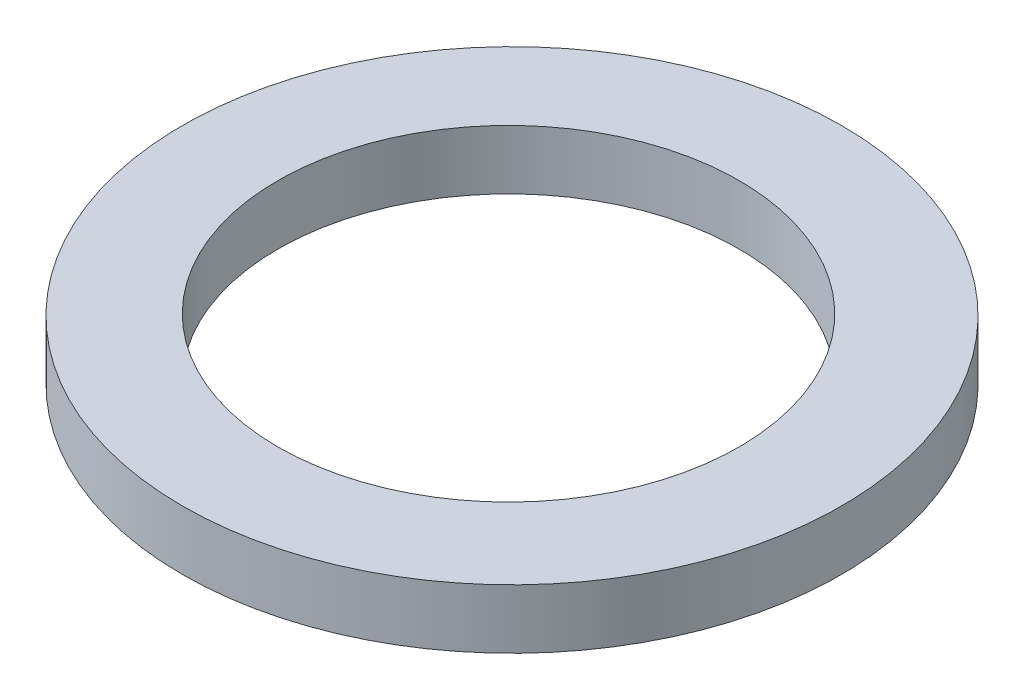
ISO-10303-21;
HEADER;
FILE_DESCRIPTION(('STEP AP214'),'2;1');
FILE_NAME('part.step','',(''),(''),'','','');
FILE_SCHEMA(('AUTOMOTIVE_DESIGN { 1 0 10303 214 1 1 1 1 }'));
ENDSEC;
DATA;
#1=APPLICATION_CONTEXT('core data for automotive mechanical design processes');
#2=APPLICATION_PROTOCOL_DEFINITION('international standard','automotive_design',2000,#1);
#3=PRODUCT_CONTEXT('',#1,'mechanical');
#4=PRODUCT('Part','Part','',(#3));
#5=PRODUCT_RELATED_PRODUCT_CATEGORY('part','',(#4));
#6=PRODUCT_DEFINITION_FORMATION('','',#4);
#7=PRODUCT_DEFINITION_CONTEXT('part definition',#1,'design');
#8=PRODUCT_DEFINITION('design','',#6,#7);
#9=PRODUCT_DEFINITION_SHAPE('','',#8);
#10=(LENGTH_UNIT() NAMED_UNIT(*) SI_UNIT(.MILLI.,.METRE.));
#11=(NAMED_UNIT(*) PLANE_ANGLE_UNIT() SI_UNIT($,.RADIAN.));
#12=(NAMED_UNIT(*) SI_UNIT($,.STERADIAN.) SOLID_ANGLE_UNIT());
#13=UNCERTAINTY_MEASURE_WITH_UNIT(LENGTH_MEASURE(1.E-05),#10,'distance_accuracy_value','');
#14=(GEOMETRIC_REPRESENTATION_CONTEXT(3) GLOBAL_UNCERTAINTY_ASSIGNED_CONTEXT((#13)) GLOBAL_UNIT_ASSIGNED_CONTEXT((#10,
#11,#12)) REPRESENTATION_CONTEXT('',''));
#15=CARTESIAN_POINT('',(0.,0.,0.));
#16=DIRECTION('',(0.,0.,1.));
#17=DIRECTION('',(1.,0.,0.));
#18=AXIS2_PLACEMENT_3D('',#15,#16,#17);
#19=CARTESIAN_POINT('',(0.268183517642549,4.572,0.));
#20=DIRECTION('',(0.,1.,0.));
#21=DIRECTION('',(0.,0.,1.));
#22=AXIS2_PLACEMENT_3D('',#19,#20,#21);
#23=PLANE('',#22);
#24=CARTESIAN_POINT('',(0.268183517642549,4.572,0.));
#25=DIRECTION('',(0.,1.,0.));
#26=DIRECTION('',(0.,0.,1.));
#27=AXIS2_PLACEMENT_3D('',#24,#25,#26);
#28=CIRCLE('',#27,25.4);
#29=CARTESIAN_POINT('',(0.268183517642549,4.572,25.4));
#30=VERTEX_POINT('',#29);
#31=EDGE_CURVE('E10',#30,#30,#28,.T.);
#32=ORIENTED_EDGE('',*,*,#31,.T.);
#33=EDGE_LOOP('',(#32));
#34=FACE_BOUND('',#33,.T.);
#35=CARTESIAN_POINT('',(0.,4.572,0.));
#36=DIRECTION('',(0.,1.,0.));
#37=DIRECTION('',(0.,0.,1.));
#38=AXIS2_PLACEMENT_3D('',#35,#36,#37);
#39=CIRCLE('',#38,17.78);
#40=CARTESIAN_POINT('',(0.,4.572,17.78));
#41=VERTEX_POINT('',#40);
#42=EDGE_CURVE('E46',#41,#41,#39,.T.);
#43=ORIENTED_EDGE('',*,*,#42,.F.);
#44=EDGE_LOOP('',(#43));
#45=FACE_BOUND('',#44,.T.);
#46=ADVANCED_FACE('F35',(#34,#45),#23,.T.);
#47=CARTESIAN_POINT('',(0.268183517642549,0.,0.));
#48=DIRECTION('',(0.,1.,0.));
#49=DIRECTION('',(0.,0.,1.));
#50=AXIS2_PLACEMENT_3D('',#47,#48,#49);
#51=PLANE('',#50);
#52=CARTESIAN_POINT('',(0.268183517642549,0.,0.));
#53=DIRECTION('',(0.,1.,0.));
#54=DIRECTION('',(0.,0.,1.));
#55=AXIS2_PLACEMENT_3D('',#52,#53,#54);
#56=CIRCLE('',#55,25.4);
#57=CARTESIAN_POINT('',(0.268183517642549,0.,25.4));
#58=VERTEX_POINT('',#57);
#59=EDGE_CURVE('E39',#58,#58,#56,.T.);
#60=ORIENTED_EDGE('',*,*,#59,.F.);
#61=EDGE_LOOP('',(#60));
#62=FACE_BOUND('',#61,.T.);
#63=CARTESIAN_POINT('',(0.,0.,0.));
#64=DIRECTION('',(0.,1.,0.));
#65=DIRECTION('',(0.,0.,1.));
#66=AXIS2_PLACEMENT_3D('',#63,#64,#65);
#67=CIRCLE('',#66,17.78);
#68=CARTESIAN_POINT('',(0.,0.,17.78));
#69=VERTEX_POINT('',#68);
#70=EDGE_CURVE('E48',#69,#69,#67,.T.);
#71=ORIENTED_EDGE('',*,*,#70,.T.);
#72=EDGE_LOOP('',(#71));
#73=FACE_BOUND('',#72,.T.);
#74=ADVANCED_FACE('F58',(#62,#73),#51,.F.);
#75=CARTESIAN_POINT('',(0.268183517642549,4.572,0.));
#76=DIRECTION('',(0.,-1.,0.));
#77=DIRECTION('',(0.,0.,-1.));
#78=AXIS2_PLACEMENT_3D('',#75,#76,#77);
#79=CYLINDRICAL_SURFACE('',#78,25.4);
#80=ORIENTED_EDGE('',*,*,#31,.F.);
#81=EDGE_LOOP('',(#80));
#82=FACE_BOUND('',#81,.T.);
#83=ORIENTED_EDGE('',*,*,#59,.T.);
#84=EDGE_LOOP('',(#83));
#85=FACE_BOUND('',#84,.T.);
#86=ADVANCED_FACE('F37',(#82,#85),#79,.T.);
#87=CARTESIAN_POINT('',(0.,4.572,0.));
#88=DIRECTION('',(0.,-1.,0.));
#89=DIRECTION('',(0.,0.,-1.));
#90=AXIS2_PLACEMENT_3D('',#87,#88,#89);
#91=CYLINDRICAL_SURFACE('',#90,17.78);
#92=ORIENTED_EDGE('',*,*,#42,.T.);
#93=EDGE_LOOP('',(#92));
#94=FACE_BOUND('',#93,.T.);
#95=ORIENTED_EDGE('',*,*,#70,.F.);
#96=EDGE_LOOP('',(#95));
#97=FACE_BOUND('',#96,.T.);
#98=ADVANCED_FACE('F54',(#94,#97),#91,.F.);
#99=CLOSED_SHELL('',(#46,#74,#86,#98));
#100=MANIFOLD_SOLID_BREP('B2',#99);
#101=ADVANCED_BREP_SHAPE_REPRESENTATION('',(#18,#100),#14);
#102=SHAPE_DEFINITION_REPRESENTATION(#9,#101);
ENDSEC;
END-ISO-10303-21;
